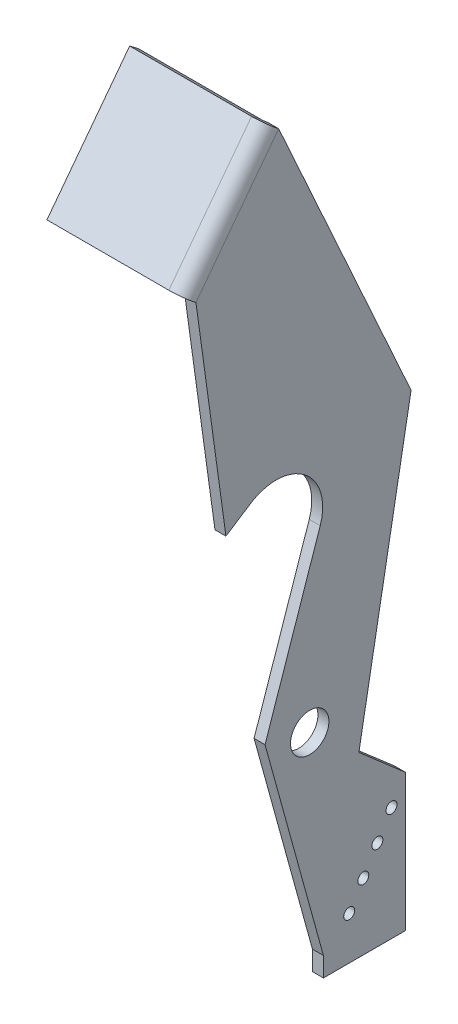
ISO-10303-21;
HEADER;
FILE_DESCRIPTION(('STEP AP214'),'2;1');
FILE_NAME('part.step','',(''),(''),'','','');
FILE_SCHEMA(('AUTOMOTIVE_DESIGN { 1 0 10303 214 1 1 1 1 }'));
ENDSEC;
DATA;
#1=APPLICATION_CONTEXT('core data for automotive mechanical design processes');
#2=APPLICATION_PROTOCOL_DEFINITION('international standard','automotive_design',2000,#1);
#3=PRODUCT_CONTEXT('',#1,'mechanical');
#4=PRODUCT('Part','Part','',(#3));
#5=PRODUCT_RELATED_PRODUCT_CATEGORY('part','',(#4));
#6=PRODUCT_DEFINITION_FORMATION('','',#4);
#7=PRODUCT_DEFINITION_CONTEXT('part definition',#1,'design');
#8=PRODUCT_DEFINITION('design','',#6,#7);
#9=PRODUCT_DEFINITION_SHAPE('','',#8);
#10=(LENGTH_UNIT() NAMED_UNIT(*) SI_UNIT(.MILLI.,.METRE.));
#11=(NAMED_UNIT(*) PLANE_ANGLE_UNIT() SI_UNIT($,.RADIAN.));
#12=(NAMED_UNIT(*) SI_UNIT($,.STERADIAN.) SOLID_ANGLE_UNIT());
#13=UNCERTAINTY_MEASURE_WITH_UNIT(LENGTH_MEASURE(1.E-05),#10,'distance_accuracy_value','');
#14=(GEOMETRIC_REPRESENTATION_CONTEXT(3) GLOBAL_UNCERTAINTY_ASSIGNED_CONTEXT((#13)) GLOBAL_UNIT_ASSIGNED_CONTEXT((#10,
#11,#12)) REPRESENTATION_CONTEXT('',''));
#15=CARTESIAN_POINT('',(0.,0.,0.));
#16=DIRECTION('',(0.,0.,1.));
#17=DIRECTION('',(1.,0.,0.));
#18=AXIS2_PLACEMENT_3D('',#15,#16,#17);
#19=CARTESIAN_POINT('',(-4.,63.4401893519098,-3.84266830118097));
#20=DIRECTION('',(0.,0.322329469670201,0.946627547128292));
#21=DIRECTION('',(0.,-0.946627547128292,0.322329469670201));
#22=AXIS2_PLACEMENT_3D('',#19,#20,#21);
#23=PLANE('',#22);
#24=DIRECTION('',(0.,-0.946627547128292,0.322329469670201));
#25=VECTOR('',#24,1.);
#26=CARTESIAN_POINT('',(0.,63.4401893519098,-3.84266830118097));
#27=LINE('',#26,#25);
#28=CARTESIAN_POINT('',(0.,63.4401893519098,-3.84266830118096));
#29=VERTEX_POINT('',#28);
#30=CARTESIAN_POINT('',(0.,4.28462847097499,16.2999745203161));
#31=VERTEX_POINT('',#30);
#32=EDGE_CURVE('E177',#29,#31,#27,.T.);
#33=ORIENTED_EDGE('',*,*,#32,.F.);
#34=DIRECTION('',(1.,0.,0.));
#35=VECTOR('',#34,1.);
#36=CARTESIAN_POINT('',(-4.,63.4401893519098,-3.84266830118096));
#37=LINE('',#36,#35);
#38=CARTESIAN_POINT('',(-4.,63.4401893519098,-3.84266830118096));
#39=VERTEX_POINT('',#38);
#40=EDGE_CURVE('E13',#39,#29,#37,.T.);
#41=ORIENTED_EDGE('',*,*,#40,.F.);
#42=DIRECTION('',(0.,-0.946627547128292,0.322329469670201));
#43=VECTOR('',#42,1.);
#44=CARTESIAN_POINT('',(-4.,63.4401893519098,-3.84266830118097));
#45=LINE('',#44,#43);
#46=CARTESIAN_POINT('',(-4.,4.28462847097499,16.2999745203161));
#47=VERTEX_POINT('',#46);
#48=EDGE_CURVE('E210',#39,#47,#45,.T.);
#49=ORIENTED_EDGE('',*,*,#48,.T.);
#50=DIRECTION('',(1.,0.,0.));
#51=VECTOR('',#50,1.);
#52=CARTESIAN_POINT('',(-4.,4.28462847097499,16.2999745203161));
#53=LINE('',#52,#51);
#54=EDGE_CURVE('E61',#47,#31,#53,.T.);
#55=ORIENTED_EDGE('',*,*,#54,.T.);
#56=EDGE_LOOP('',(#33,#41,#49,#55));
#57=FACE_BOUND('',#56,.T.);
#58=ADVANCED_FACE('F58',(#57),#23,.T.);
#59=CARTESIAN_POINT('',(-4.,68.9197903363033,12.25));
#60=DIRECTION('',(1.,0.,0.));
#61=DIRECTION('',(0.,0.,-1.));
#62=AXIS2_PLACEMENT_3D('',#59,#60,#61);
#63=CYLINDRICAL_SURFACE('',#62,17.);
#64=CARTESIAN_POINT('',(0.,68.9197903363033,12.25));
#65=DIRECTION('',(-1.,0.,0.));
#66=DIRECTION('',(0.,0.,1.));
#67=AXIS2_PLACEMENT_3D('',#64,#65,#66);
#68=CIRCLE('',#67,17.);
#69=CARTESIAN_POINT('',(0.,83.2003084561341,21.4731666053034));
#70=VERTEX_POINT('',#69);
#71=EDGE_CURVE('E208',#70,#29,#68,.T.);
#72=ORIENTED_EDGE('',*,*,#71,.F.);
#73=DIRECTION('',(1.,0.,0.));
#74=VECTOR('',#73,1.);
#75=CARTESIAN_POINT('',(-4.,83.2003084561341,21.4731666053034));
#76=LINE('',#75,#74);
#77=CARTESIAN_POINT('',(-4.,83.2003084561341,21.4731666053034));
#78=VERTEX_POINT('',#77);
#79=EDGE_CURVE('E67',#78,#70,#76,.T.);
#80=ORIENTED_EDGE('',*,*,#79,.F.);
#81=CARTESIAN_POINT('',(-4.,68.9197903363033,12.25));
#82=DIRECTION('',(-1.,0.,0.));
#83=DIRECTION('',(0.,0.,1.));
#84=AXIS2_PLACEMENT_3D('',#81,#82,#83);
#85=CIRCLE('',#84,17.);
#86=EDGE_CURVE('E164',#78,#39,#85,.T.);
#87=ORIENTED_EDGE('',*,*,#86,.T.);
#88=ORIENTED_EDGE('',*,*,#40,.T.);
#89=EDGE_LOOP('',(#72,#80,#87,#88));
#90=FACE_BOUND('',#89,.T.);
#91=ADVANCED_FACE('F231',(#90),#63,.F.);
#92=CARTESIAN_POINT('',(-4.,83.2003084561341,21.4731666053034));
#93=DIRECTION('',(0.,-0.840030477637105,-0.542539212076674));
#94=DIRECTION('',(0.,0.542539212076674,-0.840030477637105));
#95=AXIS2_PLACEMENT_3D('',#92,#93,#94);
#96=PLANE('',#95);
#97=DIRECTION('',(0.,0.542539212076674,-0.840030477637105));
#98=VECTOR('',#97,1.);
#99=CARTESIAN_POINT('',(0.,83.2003084561341,21.4731666053034));
#100=LINE('',#99,#98);
#101=CARTESIAN_POINT('',(0.,77.3245033014224,30.5708600083702));
#102=VERTEX_POINT('',#101);
#103=EDGE_CURVE('E151',#102,#70,#100,.T.);
#104=ORIENTED_EDGE('',*,*,#103,.F.);
#105=DIRECTION('',(1.,0.,0.));
#106=VECTOR('',#105,1.);
#107=CARTESIAN_POINT('',(-4.,77.3245033014224,30.5708600083702));
#108=LINE('',#107,#106);
#109=CARTESIAN_POINT('',(-4.,77.3245033014224,30.5708600083702));
#110=VERTEX_POINT('',#109);
#111=EDGE_CURVE('E146',#110,#102,#108,.T.);
#112=ORIENTED_EDGE('',*,*,#111,.F.);
#113=DIRECTION('',(0.,0.542539212076674,-0.840030477637105));
#114=VECTOR('',#113,1.);
#115=CARTESIAN_POINT('',(-4.,83.2003084561341,21.4731666053034));
#116=LINE('',#115,#114);
#117=EDGE_CURVE('E149',#110,#78,#116,.T.);
#118=ORIENTED_EDGE('',*,*,#117,.T.);
#119=ORIENTED_EDGE('',*,*,#79,.T.);
#120=EDGE_LOOP('',(#104,#112,#118,#119));
#121=FACE_BOUND('',#120,.T.);
#122=ADVANCED_FACE('F148',(#121),#96,.T.);
#123=CARTESIAN_POINT('',(-4.,156.639911011266,41.5156399534278));
#124=DIRECTION('',(0.,-0.136695292409617,0.990613141964637));
#125=DIRECTION('',(0.,-0.990613141964637,-0.136695292409617));
#126=AXIS2_PLACEMENT_3D('',#123,#124,#125);
#127=PLANE('',#126);
#128=DIRECTION('',(0.,-0.990613141964637,-0.136695292409617));
#129=VECTOR('',#128,1.);
#130=CARTESIAN_POINT('',(0.,156.639911011266,41.5156399534278));
#131=LINE('',#130,#129);
#132=CARTESIAN_POINT('',(0.,156.639911011266,41.5156399534278));
#133=VERTEX_POINT('',#132);
#134=EDGE_CURVE('E205',#133,#102,#131,.T.);
#135=ORIENTED_EDGE('',*,*,#134,.F.);
#136=DIRECTION('',(1.,0.,0.));
#137=VECTOR('',#136,1.);
#138=CARTESIAN_POINT('',(-4.,156.639911011266,41.5156399534278));
#139=LINE('',#138,#137);
#140=CARTESIAN_POINT('',(-4.00000000000002,156.639911011266,41.5156399534278));
#141=VERTEX_POINT('',#140);
#142=EDGE_CURVE('E156',#141,#133,#139,.T.);
#143=ORIENTED_EDGE('',*,*,#142,.F.);
#144=DIRECTION('',(0.,-0.990613141964637,-0.136695292409617));
#145=VECTOR('',#144,1.);
#146=CARTESIAN_POINT('',(-4.,156.639911011266,41.5156399534278));
#147=LINE('',#146,#145);
#148=EDGE_CURVE('E163',#141,#110,#147,.T.);
#149=ORIENTED_EDGE('',*,*,#148,.T.);
#150=ORIENTED_EDGE('',*,*,#111,.T.);
#151=EDGE_LOOP('',(#135,#143,#149,#150));
#152=FACE_BOUND('',#151,.T.);
#153=ADVANCED_FACE('F167',(#152),#127,.T.);
#154=CARTESIAN_POINT('',(-4.,89.6650963066228,-37.));
#155=DIRECTION('',(0.,0.412144442222116,-0.911118520690596));
#156=DIRECTION('',(0.,0.911118520690596,0.412144442222116));
#157=AXIS2_PLACEMENT_3D('',#154,#155,#156);
#158=PLANE('',#157);
#159=DIRECTION('',(0.,0.911118520690596,0.412144442222116));
#160=VECTOR('',#159,1.);
#161=CARTESIAN_POINT('',(0.,89.6650963066228,-37.));
#162=LINE('',#161,#160);
#163=CARTESIAN_POINT('',(0.,89.6650963066228,-37.));
#164=VERTEX_POINT('',#163);
#165=CARTESIAN_POINT('',(0.,196.496282933007,11.3250848535983));
#166=VERTEX_POINT('',#165);
#167=EDGE_CURVE('E199',#164,#166,#162,.T.);
#168=ORIENTED_EDGE('',*,*,#167,.F.);
#169=DIRECTION('',(1.,0.,0.));
#170=VECTOR('',#169,1.);
#171=CARTESIAN_POINT('',(-4.,89.6650963066228,-37.));
#172=LINE('',#171,#170);
#173=CARTESIAN_POINT('',(-4.,89.6650963066228,-37.));
#174=VERTEX_POINT('',#173);
#175=EDGE_CURVE('E217',#174,#164,#172,.T.);
#176=ORIENTED_EDGE('',*,*,#175,.F.);
#177=DIRECTION('',(0.,0.911118520690596,0.412144442222116));
#178=VECTOR('',#177,1.);
#179=CARTESIAN_POINT('',(-4.,89.6650963066228,-37.));
#180=LINE('',#179,#178);
#181=CARTESIAN_POINT('',(-4.00000000000002,196.496282933007,11.3250848535983));
#182=VERTEX_POINT('',#181);
#183=EDGE_CURVE('E172',#174,#182,#180,.T.);
#184=ORIENTED_EDGE('',*,*,#183,.T.);
#185=DIRECTION('',(1.,0.,0.));
#186=VECTOR('',#185,1.);
#187=CARTESIAN_POINT('',(-4.,196.496282933007,11.3250848535983));
#188=LINE('',#187,#186);
#189=EDGE_CURVE('E214',#182,#166,#188,.T.);
#190=ORIENTED_EDGE('',*,*,#189,.T.);
#191=EDGE_LOOP('',(#168,#176,#184,#190));
#192=FACE_BOUND('',#191,.T.);
#193=ADVANCED_FACE('F244',(#192),#158,.T.);
#194=CARTESIAN_POINT('',(-4.,-15.2866861849528,-17.9522006629487));
#195=DIRECTION('',(0.,-0.178573765967968,-0.983926526783386));
#196=DIRECTION('',(0.,0.983926526783386,-0.178573765967968));
#197=AXIS2_PLACEMENT_3D('',#194,#195,#196);
#198=PLANE('',#197);
#199=DIRECTION('',(0.,0.983926526783386,-0.178573765967968));
#200=VECTOR('',#199,1.);
#201=CARTESIAN_POINT('',(0.,-15.2866861849528,-17.9522006629487));
#202=LINE('',#201,#200);
#203=CARTESIAN_POINT('',(0.,-15.2866861849528,-17.9522006629487));
#204=VERTEX_POINT('',#203);
#205=EDGE_CURVE('E196',#204,#164,#202,.T.);
#206=ORIENTED_EDGE('',*,*,#205,.F.);
#207=DIRECTION('',(1.,0.,0.));
#208=VECTOR('',#207,1.);
#209=CARTESIAN_POINT('',(-4.,-15.2866861849528,-17.9522006629487));
#210=LINE('',#209,#208);
#211=CARTESIAN_POINT('',(-4.,-15.2866861849528,-17.9522006629487));
#212=VERTEX_POINT('',#211);
#213=EDGE_CURVE('E219',#212,#204,#210,.T.);
#214=ORIENTED_EDGE('',*,*,#213,.F.);
#215=DIRECTION('',(0.,0.983926526783386,-0.178573765967968));
#216=VECTOR('',#215,1.);
#217=CARTESIAN_POINT('',(-4.,-15.2866861849528,-17.9522006629487));
#218=LINE('',#217,#216);
#219=EDGE_CURVE('E436',#212,#174,#218,.T.);
#220=ORIENTED_EDGE('',*,*,#219,.T.);
#221=ORIENTED_EDGE('',*,*,#175,.T.);
#222=EDGE_LOOP('',(#206,#214,#220,#221));
#223=FACE_BOUND('',#222,.T.);
#224=ADVANCED_FACE('F247',(#223),#198,.T.);
#225=CARTESIAN_POINT('',(-4.,-30.1092645252368,-35.));
#226=DIRECTION('',(0.,0.75464048126496,-0.656138509795143));
#227=DIRECTION('',(0.,0.656138509795143,0.75464048126496));
#228=AXIS2_PLACEMENT_3D('',#225,#226,#227);
#229=PLANE('',#228);
#230=DIRECTION('',(0.,0.656138509795143,0.75464048126496));
#231=VECTOR('',#230,1.);
#232=CARTESIAN_POINT('',(0.,-30.1092645252368,-35.));
#233=LINE('',#232,#231);
#234=CARTESIAN_POINT('',(0.,-30.1092645252368,-35.));
#235=VERTEX_POINT('',#234);
#236=EDGE_CURVE('E193',#235,#204,#233,.T.);
#237=ORIENTED_EDGE('',*,*,#236,.F.);
#238=DIRECTION('',(1.,0.,0.));
#239=VECTOR('',#238,1.);
#240=CARTESIAN_POINT('',(-4.,-30.1092645252368,-35.));
#241=LINE('',#240,#239);
#242=CARTESIAN_POINT('',(-4.,-30.1092645252368,-35.));
#243=VERTEX_POINT('',#242);
#244=EDGE_CURVE('E221',#243,#235,#241,.T.);
#245=ORIENTED_EDGE('',*,*,#244,.F.);
#246=DIRECTION('',(0.,0.656138509795143,0.75464048126496));
#247=VECTOR('',#246,1.);
#248=CARTESIAN_POINT('',(-4.,-30.1092645252368,-35.));
#249=LINE('',#248,#247);
#250=EDGE_CURVE('E433',#243,#212,#249,.T.);
#251=ORIENTED_EDGE('',*,*,#250,.T.);
#252=ORIENTED_EDGE('',*,*,#213,.T.);
#253=EDGE_LOOP('',(#237,#245,#251,#252));
#254=FACE_BOUND('',#253,.T.);
#255=ADVANCED_FACE('F251',(#254),#229,.T.);
#256=CARTESIAN_POINT('',(-4.,-30.1092645252368,-35.));
#257=DIRECTION('',(0.,0.,-1.));
#258=DIRECTION('',(-1.,0.,0.));
#259=AXIS2_PLACEMENT_3D('',#256,#257,#258);
#260=PLANE('',#259);
#261=DIRECTION('',(0.,1.,0.));
#262=VECTOR('',#261,1.);
#263=CARTESIAN_POINT('',(0.,-30.1092645252368,-35.));
#264=LINE('',#263,#262);
#265=CARTESIAN_POINT('',(0.,-80.1092645252368,-35.));
#266=VERTEX_POINT('',#265);
#267=EDGE_CURVE('E190',#266,#235,#264,.T.);
#268=ORIENTED_EDGE('',*,*,#267,.F.);
#269=DIRECTION('',(1.,0.,0.));
#270=VECTOR('',#269,1.);
#271=CARTESIAN_POINT('',(-4.,-80.1092645252368,-35.));
#272=LINE('',#271,#270);
#273=CARTESIAN_POINT('',(-4.,-80.1092645252368,-35.));
#274=VERTEX_POINT('',#273);
#275=EDGE_CURVE('E223',#274,#266,#272,.T.);
#276=ORIENTED_EDGE('',*,*,#275,.F.);
#277=DIRECTION('',(0.,1.,0.));
#278=VECTOR('',#277,1.);
#279=CARTESIAN_POINT('',(-4.,-30.1092645252368,-35.));
#280=LINE('',#279,#278);
#281=EDGE_CURVE('E430',#274,#243,#280,.T.);
#282=ORIENTED_EDGE('',*,*,#281,.T.);
#283=ORIENTED_EDGE('',*,*,#244,.T.);
#284=EDGE_LOOP('',(#268,#276,#282,#283));
#285=FACE_BOUND('',#284,.T.);
#286=ADVANCED_FACE('F255',(#285),#260,.T.);
#287=CARTESIAN_POINT('',(-4.,-80.1092645252368,-5.));
#288=DIRECTION('',(0.,-1.,0.));
#289=DIRECTION('',(0.,0.,-1.));
#290=AXIS2_PLACEMENT_3D('',#287,#288,#289);
#291=PLANE('',#290);
#292=DIRECTION('',(0.,0.,-1.));
#293=VECTOR('',#292,1.);
#294=CARTESIAN_POINT('',(0.,-80.1092645252368,-5.));
#295=LINE('',#294,#293);
#296=CARTESIAN_POINT('',(0.,-80.1092645252368,-5.));
#297=VERTEX_POINT('',#296);
#298=EDGE_CURVE('E187',#297,#266,#295,.T.);
#299=ORIENTED_EDGE('',*,*,#298,.F.);
#300=DIRECTION('',(1.,0.,0.));
#301=VECTOR('',#300,1.);
#302=CARTESIAN_POINT('',(-4.,-80.1092645252368,-5.));
#303=LINE('',#302,#301);
#304=CARTESIAN_POINT('',(-4.,-80.1092645252368,-5.));
#305=VERTEX_POINT('',#304);
#306=EDGE_CURVE('E225',#305,#297,#303,.T.);
#307=ORIENTED_EDGE('',*,*,#306,.F.);
#308=DIRECTION('',(0.,0.,-1.));
#309=VECTOR('',#308,1.);
#310=CARTESIAN_POINT('',(-4.,-80.1092645252368,-5.));
#311=LINE('',#310,#309);
#312=EDGE_CURVE('E427',#305,#274,#311,.T.);
#313=ORIENTED_EDGE('',*,*,#312,.T.);
#314=ORIENTED_EDGE('',*,*,#275,.T.);
#315=EDGE_LOOP('',(#299,#307,#313,#314));
#316=FACE_BOUND('',#315,.T.);
#317=ADVANCED_FACE('F259',(#316),#291,.T.);
#318=CARTESIAN_POINT('',(-4.,-72.9877114530115,-5.00000000000001));
#319=DIRECTION('',(0.,0.,1.));
#320=DIRECTION('',(0.,-1.,0.));
#321=AXIS2_PLACEMENT_3D('',#318,#319,#320);
#322=PLANE('',#321);
#323=DIRECTION('',(0.,-1.,0.));
#324=VECTOR('',#323,1.);
#325=CARTESIAN_POINT('',(0.,-72.9877114530115,-5.00000000000001));
#326=LINE('',#325,#324);
#327=CARTESIAN_POINT('',(0.,-72.9877114530115,-5.00000000000001));
#328=VERTEX_POINT('',#327);
#329=EDGE_CURVE('E184',#328,#297,#326,.T.);
#330=ORIENTED_EDGE('',*,*,#329,.F.);
#331=DIRECTION('',(1.,0.,0.));
#332=VECTOR('',#331,1.);
#333=CARTESIAN_POINT('',(-4.,-72.9877114530115,-5.00000000000001));
#334=LINE('',#333,#332);
#335=CARTESIAN_POINT('',(-4.,-72.9877114530115,-5.00000000000001));
#336=VERTEX_POINT('',#335);
#337=EDGE_CURVE('E226',#336,#328,#334,.T.);
#338=ORIENTED_EDGE('',*,*,#337,.F.);
#339=DIRECTION('',(0.,-1.,0.));
#340=VECTOR('',#339,1.);
#341=CARTESIAN_POINT('',(-4.,-72.9877114530115,-5.00000000000001));
#342=LINE('',#341,#340);
#343=EDGE_CURVE('E424',#336,#305,#342,.T.);
#344=ORIENTED_EDGE('',*,*,#343,.T.);
#345=ORIENTED_EDGE('',*,*,#306,.T.);
#346=EDGE_LOOP('',(#330,#338,#344,#345));
#347=FACE_BOUND('',#346,.T.);
#348=ADVANCED_FACE('F263',(#347),#322,.T.);
#349=CARTESIAN_POINT('',(-4.,4.28462847097499,16.2999745203161));
#350=DIRECTION('',(0.,-0.26573731422864,0.964045476015809));
#351=DIRECTION('',(0.,-0.96404547601581,-0.26573731422864));
#352=AXIS2_PLACEMENT_3D('',#349,#350,#351);
#353=PLANE('',#352);
#354=DIRECTION('',(0.,-0.964045476015809,-0.26573731422864));
#355=VECTOR('',#354,1.);
#356=CARTESIAN_POINT('',(0.,4.28462847097499,16.2999745203161));
#357=LINE('',#356,#355);
#358=EDGE_CURVE('E180',#31,#328,#357,.T.);
#359=ORIENTED_EDGE('',*,*,#358,.F.);
#360=ORIENTED_EDGE('',*,*,#54,.F.);
#361=DIRECTION('',(0.,-0.964045476015809,-0.26573731422864));
#362=VECTOR('',#361,1.);
#363=CARTESIAN_POINT('',(-4.,4.28462847097499,16.2999745203161));
#364=LINE('',#363,#362);
#365=EDGE_CURVE('E422',#47,#336,#364,.T.);
#366=ORIENTED_EDGE('',*,*,#365,.T.);
#367=ORIENTED_EDGE('',*,*,#337,.T.);
#368=EDGE_LOOP('',(#359,#360,#366,#367));
#369=FACE_BOUND('',#368,.T.);
#370=ADVANCED_FACE('F228',(#369),#353,.T.);
#371=CARTESIAN_POINT('',(-4.,68.9197903363033,12.25));
#372=DIRECTION('',(-1.,0.,0.));
#373=DIRECTION('',(0.,0.,1.));
#374=AXIS2_PLACEMENT_3D('',#371,#372,#373);
#375=PLANE('',#374);
#376=CARTESIAN_POINT('',(-4.,-64.4089815537385,-14.420169782899));
#377=DIRECTION('',(1.,0.,0.));
#378=DIRECTION('',(0.,0.,-1.));
#379=AXIS2_PLACEMENT_3D('',#376,#377,#378);
#380=CIRCLE('',#379,2.00000000000001);
#381=CARTESIAN_POINT('',(-4.,-64.4089815537385,-16.420169782899));
#382=VERTEX_POINT('',#381);
#383=EDGE_CURVE('E394',#382,#382,#380,.T.);
#384=ORIENTED_EDGE('',*,*,#383,.T.);
#385=EDGE_LOOP('',(#384));
#386=FACE_BOUND('',#385,.T.);
#387=CARTESIAN_POINT('',(-4.,-55.8340522966131,-19.5651273371742));
#388=DIRECTION('',(1.,0.,0.));
#389=DIRECTION('',(0.,0.,-1.));
#390=AXIS2_PLACEMENT_3D('',#387,#388,#389);
#391=CIRCLE('',#390,2.00000000000001);
#392=CARTESIAN_POINT('',(-4.,-55.8340522966131,-21.5651273371742));
#393=VERTEX_POINT('',#392);
#394=EDGE_CURVE('E399',#393,#393,#391,.T.);
#395=ORIENTED_EDGE('',*,*,#394,.T.);
#396=EDGE_LOOP('',(#395));
#397=FACE_BOUND('',#396,.T.);
#398=CARTESIAN_POINT('',(-4.,-47.2591230394876,-24.7100848914495));
#399=DIRECTION('',(1.,0.,0.));
#400=DIRECTION('',(0.,0.,-1.));
#401=AXIS2_PLACEMENT_3D('',#398,#399,#400);
#402=CIRCLE('',#401,2.);
#403=CARTESIAN_POINT('',(-4.,-47.2591230394876,-26.7100848914495));
#404=VERTEX_POINT('',#403);
#405=EDGE_CURVE('E405',#404,#404,#402,.T.);
#406=ORIENTED_EDGE('',*,*,#405,.T.);
#407=EDGE_LOOP('',(#406));
#408=FACE_BOUND('',#407,.T.);
#409=CARTESIAN_POINT('',(-4.,-38.6841937823622,-29.8550424457247));
#410=DIRECTION('',(1.,0.,0.));
#411=DIRECTION('',(0.,0.,-1.));
#412=AXIS2_PLACEMENT_3D('',#409,#410,#411);
#413=CIRCLE('',#412,2.00000000000001);
#414=CARTESIAN_POINT('',(-4.,-38.6841937823622,-31.8550424457247));
#415=VERTEX_POINT('',#414);
#416=EDGE_CURVE('E411',#415,#415,#413,.T.);
#417=ORIENTED_EDGE('',*,*,#416,.T.);
#418=EDGE_LOOP('',(#417));
#419=FACE_BOUND('',#418,.T.);
#420=CARTESIAN_POINT('',(-4.,0.,0.));
#421=DIRECTION('',(1.,0.,0.));
#422=DIRECTION('',(0.,0.,-1.));
#423=AXIS2_PLACEMENT_3D('',#420,#421,#422);
#424=CIRCLE('',#423,7.);
#425=CARTESIAN_POINT('',(-4.,0.,-7.));
#426=VERTEX_POINT('',#425);
#427=EDGE_CURVE('E181',#426,#426,#424,.T.);
#428=ORIENTED_EDGE('',*,*,#427,.T.);
#429=EDGE_LOOP('',(#428));
#430=FACE_BOUND('',#429,.T.);
#431=ORIENTED_EDGE('',*,*,#48,.F.);
#432=ORIENTED_EDGE('',*,*,#86,.F.);
#433=ORIENTED_EDGE('',*,*,#117,.F.);
#434=ORIENTED_EDGE('',*,*,#148,.F.);
#435=DIRECTION('',(0.,-0.797127438434824,0.603811101996589));
#436=VECTOR('',#435,1.);
#437=CARTESIAN_POINT('',(-4.,196.496282933007,11.3250848535983));
#438=LINE('',#437,#436);
#439=EDGE_CURVE('E169',#182,#141,#438,.T.);
#440=ORIENTED_EDGE('',*,*,#439,.F.);
#441=ORIENTED_EDGE('',*,*,#183,.F.);
#442=ORIENTED_EDGE('',*,*,#219,.F.);
#443=ORIENTED_EDGE('',*,*,#250,.F.);
#444=ORIENTED_EDGE('',*,*,#281,.F.);
#445=ORIENTED_EDGE('',*,*,#312,.F.);
#446=ORIENTED_EDGE('',*,*,#343,.F.);
#447=ORIENTED_EDGE('',*,*,#365,.F.);
#448=EDGE_LOOP('',(#431,#432,#433,#434,#440,#441,#442,#443,#444,#445,#446,#447));
#449=FACE_BOUND('',#448,.T.);
#450=ADVANCED_FACE('F160',(#386,#397,#408,#419,#430,#449),#375,.T.);
#451=CARTESIAN_POINT('',(0.,68.9197903363033,12.25));
#452=DIRECTION('',(-1.,0.,0.));
#453=DIRECTION('',(0.,0.,1.));
#454=AXIS2_PLACEMENT_3D('',#451,#452,#453);
#455=PLANE('',#454);
#456=CARTESIAN_POINT('',(0.,-64.4089815537385,-14.420169782899));
#457=DIRECTION('',(1.,0.,0.));
#458=DIRECTION('',(0.,0.,-1.));
#459=AXIS2_PLACEMENT_3D('',#456,#457,#458);
#460=CIRCLE('',#459,2.00000000000001);
#461=CARTESIAN_POINT('',(0.,-64.4089815537385,-16.420169782899));
#462=VERTEX_POINT('',#461);
#463=EDGE_CURVE('E384',#462,#462,#460,.T.);
#464=ORIENTED_EDGE('',*,*,#463,.F.);
#465=EDGE_LOOP('',(#464));
#466=FACE_BOUND('',#465,.T.);
#467=CARTESIAN_POINT('',(0.,-55.8340522966131,-19.5651273371742));
#468=DIRECTION('',(1.,0.,0.));
#469=DIRECTION('',(0.,0.,-1.));
#470=AXIS2_PLACEMENT_3D('',#467,#468,#469);
#471=CIRCLE('',#470,2.00000000000001);
#472=CARTESIAN_POINT('',(0.,-55.8340522966131,-21.5651273371742));
#473=VERTEX_POINT('',#472);
#474=EDGE_CURVE('E396',#473,#473,#471,.T.);
#475=ORIENTED_EDGE('',*,*,#474,.F.);
#476=EDGE_LOOP('',(#475));
#477=FACE_BOUND('',#476,.T.);
#478=CARTESIAN_POINT('',(0.,-47.2591230394876,-24.7100848914495));
#479=DIRECTION('',(1.,0.,0.));
#480=DIRECTION('',(0.,0.,-1.));
#481=AXIS2_PLACEMENT_3D('',#478,#479,#480);
#482=CIRCLE('',#481,2.);
#483=CARTESIAN_POINT('',(0.,-47.2591230394876,-26.7100848914495));
#484=VERTEX_POINT('',#483);
#485=EDGE_CURVE('E402',#484,#484,#482,.T.);
#486=ORIENTED_EDGE('',*,*,#485,.F.);
#487=EDGE_LOOP('',(#486));
#488=FACE_BOUND('',#487,.T.);
#489=CARTESIAN_POINT('',(0.,-38.6841937823622,-29.8550424457247));
#490=DIRECTION('',(1.,0.,0.));
#491=DIRECTION('',(0.,0.,-1.));
#492=AXIS2_PLACEMENT_3D('',#489,#490,#491);
#493=CIRCLE('',#492,2.00000000000001);
#494=CARTESIAN_POINT('',(0.,-38.6841937823622,-31.8550424457247));
#495=VERTEX_POINT('',#494);
#496=EDGE_CURVE('E408',#495,#495,#493,.T.);
#497=ORIENTED_EDGE('',*,*,#496,.F.);
#498=EDGE_LOOP('',(#497));
#499=FACE_BOUND('',#498,.T.);
#500=CARTESIAN_POINT('',(0.,0.,0.));
#501=DIRECTION('',(1.,0.,0.));
#502=DIRECTION('',(0.,0.,-1.));
#503=AXIS2_PLACEMENT_3D('',#500,#501,#502);
#504=CIRCLE('',#503,7.);
#505=CARTESIAN_POINT('',(0.,0.,-7.));
#506=VERTEX_POINT('',#505);
#507=EDGE_CURVE('E414',#506,#506,#504,.T.);
#508=ORIENTED_EDGE('',*,*,#507,.F.);
#509=EDGE_LOOP('',(#508));
#510=FACE_BOUND('',#509,.T.);
#511=ORIENTED_EDGE('',*,*,#32,.T.);
#512=ORIENTED_EDGE('',*,*,#358,.T.);
#513=ORIENTED_EDGE('',*,*,#329,.T.);
#514=ORIENTED_EDGE('',*,*,#298,.T.);
#515=ORIENTED_EDGE('',*,*,#267,.T.);
#516=ORIENTED_EDGE('',*,*,#236,.T.);
#517=ORIENTED_EDGE('',*,*,#205,.T.);
#518=ORIENTED_EDGE('',*,*,#167,.T.);
#519=DIRECTION('',(0.,-0.797127438434824,0.603811101996589));
#520=VECTOR('',#519,1.);
#521=CARTESIAN_POINT('',(0.,196.496282933007,11.3250848535983));
#522=LINE('',#521,#520);
#523=EDGE_CURVE('E202',#166,#133,#522,.T.);
#524=ORIENTED_EDGE('',*,*,#523,.T.);
#525=ORIENTED_EDGE('',*,*,#134,.T.);
#526=ORIENTED_EDGE('',*,*,#103,.T.);
#527=ORIENTED_EDGE('',*,*,#71,.T.);
#528=EDGE_LOOP('',(#511,#512,#513,#514,#515,#516,#517,#518,#524,#525,#526,#527));
#529=FACE_BOUND('',#528,.T.);
#530=ADVANCED_FACE('F230',(#466,#477,#488,#499,#510,#529),#455,.F.);
#531=CARTESIAN_POINT('',(-4.,0.,0.));
#532=DIRECTION('',(1.,0.,0.));
#533=DIRECTION('',(0.,0.,-1.));
#534=AXIS2_PLACEMENT_3D('',#531,#532,#533);
#535=CYLINDRICAL_SURFACE('',#534,7.);
#536=ORIENTED_EDGE('',*,*,#427,.F.);
#537=EDGE_LOOP('',(#536));
#538=FACE_BOUND('',#537,.T.);
#539=ORIENTED_EDGE('',*,*,#507,.T.);
#540=EDGE_LOOP('',(#539));
#541=FACE_BOUND('',#540,.T.);
#542=ADVANCED_FACE('F275',(#538,#541),#535,.F.);
#543=CARTESIAN_POINT('',(-4.,-38.6841937823622,-29.8550424457247));
#544=DIRECTION('',(1.,0.,0.));
#545=DIRECTION('',(0.,0.,-1.));
#546=AXIS2_PLACEMENT_3D('',#543,#544,#545);
#547=CYLINDRICAL_SURFACE('',#546,2.00000000000001);
#548=ORIENTED_EDGE('',*,*,#416,.F.);
#549=EDGE_LOOP('',(#548));
#550=FACE_BOUND('',#549,.T.);
#551=ORIENTED_EDGE('',*,*,#496,.T.);
#552=EDGE_LOOP('',(#551));
#553=FACE_BOUND('',#552,.T.);
#554=ADVANCED_FACE('F282',(#550,#553),#547,.F.);
#555=CARTESIAN_POINT('',(-4.,-47.2591230394876,-24.7100848914495));
#556=DIRECTION('',(1.,0.,0.));
#557=DIRECTION('',(0.,0.,-1.));
#558=AXIS2_PLACEMENT_3D('',#555,#556,#557);
#559=CYLINDRICAL_SURFACE('',#558,2.);
#560=ORIENTED_EDGE('',*,*,#405,.F.);
#561=EDGE_LOOP('',(#560));
#562=FACE_BOUND('',#561,.T.);
#563=ORIENTED_EDGE('',*,*,#485,.T.);
#564=EDGE_LOOP('',(#563));
#565=FACE_BOUND('',#564,.T.);
#566=ADVANCED_FACE('F286',(#562,#565),#559,.F.);
#567=CARTESIAN_POINT('',(-4.,-55.8340522966131,-19.5651273371742));
#568=DIRECTION('',(1.,0.,0.));
#569=DIRECTION('',(0.,0.,-1.));
#570=AXIS2_PLACEMENT_3D('',#567,#568,#569);
#571=CYLINDRICAL_SURFACE('',#570,2.00000000000001);
#572=ORIENTED_EDGE('',*,*,#394,.F.);
#573=EDGE_LOOP('',(#572));
#574=FACE_BOUND('',#573,.T.);
#575=ORIENTED_EDGE('',*,*,#474,.T.);
#576=EDGE_LOOP('',(#575));
#577=FACE_BOUND('',#576,.T.);
#578=ADVANCED_FACE('F290',(#574,#577),#571,.F.);
#579=CARTESIAN_POINT('',(-4.,-64.4089815537385,-14.420169782899));
#580=DIRECTION('',(1.,0.,0.));
#581=DIRECTION('',(0.,0.,-1.));
#582=AXIS2_PLACEMENT_3D('',#579,#580,#581);
#583=CYLINDRICAL_SURFACE('',#582,2.00000000000001);
#584=ORIENTED_EDGE('',*,*,#383,.F.);
#585=EDGE_LOOP('',(#584));
#586=FACE_BOUND('',#585,.T.);
#587=ORIENTED_EDGE('',*,*,#463,.T.);
#588=EDGE_LOOP('',(#587));
#589=FACE_BOUND('',#588,.T.);
#590=ADVANCED_FACE('F294',(#586,#589),#583,.F.);
#591=CARTESIAN_POINT('',(-5.50000000000001,156.639911011266,41.5156399534278));
#592=DIRECTION('',(0.,-0.797127438434824,0.60381110199659));
#593=DIRECTION('',(0.,-0.60381110199659,-0.797127438434824));
#594=AXIS2_PLACEMENT_3D('',#591,#592,#593);
#595=PLANE('',#594);
#596=DIRECTION('',(0.,-0.603811101996589,-0.797127438434824));
#597=VECTOR('',#596,1.);
#598=CARTESIAN_POINT('',(-5.49999999999999,159.960872072247,45.8998408648194));
#599=LINE('',#598,#597);
#600=CARTESIAN_POINT('',(-5.50000000000001,157.545627664261,42.7113311110801));
#601=VERTEX_POINT('',#600);
#602=CARTESIAN_POINT('',(-5.49999999999999,159.960872072247,45.8998408648194));
#603=VERTEX_POINT('',#602);
#604=EDGE_CURVE('E379',#601,#603,#599,.F.);
#605=ORIENTED_EDGE('',*,*,#604,.F.);
#606=CARTESIAN_POINT('',(-5.50000000000001,156.639911011266,41.5156399534278));
#607=DIRECTION('',(0.,0.797127438434824,-0.60381110199659));
#608=DIRECTION('',(0.,0.60381110199659,0.797127438434824));
#609=AXIS2_PLACEMENT_3D('',#606,#607,#608);
#610=CIRCLE('',#609,1.49999999999999);
#611=EDGE_CURVE('E388',#141,#601,#610,.F.);
#612=ORIENTED_EDGE('',*,*,#611,.F.);
#613=ORIENTED_EDGE('',*,*,#142,.T.);
#614=CARTESIAN_POINT('',(-5.50000000000001,156.639911011266,41.5156399534278));
#615=DIRECTION('',(0.,0.797127438434824,-0.60381110199659));
#616=DIRECTION('',(0.,0.60381110199659,0.797127438434824));
#617=AXIS2_PLACEMENT_3D('',#614,#615,#616);
#618=CIRCLE('',#617,5.49999999999999);
#619=EDGE_CURVE('E381',#133,#603,#618,.F.);
#620=ORIENTED_EDGE('',*,*,#619,.T.);
#621=EDGE_LOOP('',(#605,#612,#613,#620));
#622=FACE_BOUND('',#621,.T.);
#623=ADVANCED_FACE('F298',(#622),#595,.T.);
#624=CARTESIAN_POINT('',(-5.50000000000001,196.496282933007,11.3250848535983));
#625=DIRECTION('',(0.,-0.797127438434824,0.60381110199659));
#626=DIRECTION('',(0.,-0.60381110199659,-0.797127438434824));
#627=AXIS2_PLACEMENT_3D('',#624,#625,#626);
#628=PLANE('',#627);
#629=CARTESIAN_POINT('',(-5.50000000000001,196.496282933007,11.3250848535983));
#630=DIRECTION('',(0.,0.797127438434824,-0.60381110199659));
#631=DIRECTION('',(0.,0.60381110199659,0.797127438434824));
#632=AXIS2_PLACEMENT_3D('',#629,#630,#631);
#633=CIRCLE('',#632,1.49999999999999);
#634=CARTESIAN_POINT('',(-5.50000000000001,197.401999586002,12.5207760112506));
#635=VERTEX_POINT('',#634);
#636=EDGE_CURVE('E391',#635,#182,#633,.T.);
#637=ORIENTED_EDGE('',*,*,#636,.F.);
#638=DIRECTION('',(0.,-0.603811101996589,-0.797127438434824));
#639=VECTOR('',#638,1.);
#640=CARTESIAN_POINT('',(-5.50000000000001,197.401999586002,12.5207760112506));
#641=LINE('',#640,#639);
#642=CARTESIAN_POINT('',(-5.49999999999999,199.817243993989,15.7092857649899));
#643=VERTEX_POINT('',#642);
#644=EDGE_CURVE('E373',#635,#643,#641,.F.);
#645=ORIENTED_EDGE('',*,*,#644,.T.);
#646=CARTESIAN_POINT('',(-5.50000000000001,196.496282933007,11.3250848535983));
#647=DIRECTION('',(0.,0.797127438434824,-0.60381110199659));
#648=DIRECTION('',(0.,0.60381110199659,0.797127438434824));
#649=AXIS2_PLACEMENT_3D('',#646,#647,#648);
#650=CIRCLE('',#649,5.49999999999999);
#651=EDGE_CURVE('E385',#643,#166,#650,.T.);
#652=ORIENTED_EDGE('',*,*,#651,.T.);
#653=ORIENTED_EDGE('',*,*,#189,.F.);
#654=EDGE_LOOP('',(#637,#645,#652,#653));
#655=FACE_BOUND('',#654,.T.);
#656=ADVANCED_FACE('F300',(#655),#628,.F.);
#657=CARTESIAN_POINT('',(-5.50000000000001,196.496282933007,11.3250848535983));
#658=DIRECTION('',(0.,0.797127438434824,-0.60381110199659));
#659=DIRECTION('',(0.,0.60381110199659,0.797127438434824));
#660=AXIS2_PLACEMENT_3D('',#657,#658,#659);
#661=CYLINDRICAL_SURFACE('',#660,5.49999999999999);
#662=ORIENTED_EDGE('',*,*,#523,.F.);
#663=ORIENTED_EDGE('',*,*,#651,.F.);
#664=DIRECTION('',(0.,0.797127438434824,-0.603811101996589));
#665=VECTOR('',#664,1.);
#666=CARTESIAN_POINT('',(-5.49999999999999,80.4120441659244,106.156787401457));
#667=LINE('',#666,#665);
#668=EDGE_CURVE('E345',#603,#643,#667,.T.);
#669=ORIENTED_EDGE('',*,*,#668,.F.);
#670=ORIENTED_EDGE('',*,*,#619,.F.);
#671=EDGE_LOOP('',(#662,#663,#669,#670));
#672=FACE_BOUND('',#671,.T.);
#673=ADVANCED_FACE('F303',(#672),#661,.T.);
#674=CARTESIAN_POINT('',(-5.50000000000001,196.496282933007,11.3250848535983));
#675=DIRECTION('',(0.,0.797127438434824,-0.60381110199659));
#676=DIRECTION('',(0.,0.60381110199659,0.797127438434824));
#677=AXIS2_PLACEMENT_3D('',#674,#675,#676);
#678=CYLINDRICAL_SURFACE('',#677,1.49999999999999);
#679=ORIENTED_EDGE('',*,*,#439,.T.);
#680=ORIENTED_EDGE('',*,*,#611,.T.);
#681=DIRECTION('',(0.,-0.797127438434824,0.603811101996589));
#682=VECTOR('',#681,1.);
#683=CARTESIAN_POINT('',(-5.50000000000001,157.545627664261,42.7113311110801));
#684=LINE('',#683,#682);
#685=EDGE_CURVE('E376',#601,#635,#684,.F.);
#686=ORIENTED_EDGE('',*,*,#685,.T.);
#687=ORIENTED_EDGE('',*,*,#636,.T.);
#688=EDGE_LOOP('',(#679,#680,#686,#687));
#689=FACE_BOUND('',#688,.T.);
#690=ADVANCED_FACE('F308',(#689),#678,.F.);
#691=CARTESIAN_POINT('',(-3.99999999999999,199.817243993989,15.7092857649899));
#692=DIRECTION('',(0.,-0.797127438434824,0.603811101996589));
#693=DIRECTION('',(0.,-0.603811101996589,-0.797127438434824));
#694=AXIS2_PLACEMENT_3D('',#691,#692,#693);
#695=PLANE('',#694);
#696=ORIENTED_EDGE('',*,*,#644,.F.);
#697=DIRECTION('',(-1.,0.,0.));
#698=VECTOR('',#697,1.);
#699=CARTESIAN_POINT('',(-4.,197.401999586002,12.5207760112506));
#700=LINE('',#699,#698);
#701=CARTESIAN_POINT('',(-50.,197.401999586002,12.5207760112507));
#702=VERTEX_POINT('',#701);
#703=EDGE_CURVE('E369',#635,#702,#700,.T.);
#704=ORIENTED_EDGE('',*,*,#703,.T.);
#705=DIRECTION('',(0.,-0.603811101996589,-0.797127438434824));
#706=VECTOR('',#705,1.);
#707=CARTESIAN_POINT('',(-50.,199.817243993989,15.70928576499));
#708=LINE('',#707,#706);
#709=CARTESIAN_POINT('',(-50.,199.817243993989,15.70928576499));
#710=VERTEX_POINT('',#709);
#711=EDGE_CURVE('E356',#710,#702,#708,.T.);
#712=ORIENTED_EDGE('',*,*,#711,.F.);
#713=DIRECTION('',(1.,0.,0.));
#714=VECTOR('',#713,1.);
#715=CARTESIAN_POINT('',(4.4691839979787E-13,199.817243993989,15.7092857649899));
#716=LINE('',#715,#714);
#717=EDGE_CURVE('E358',#643,#710,#716,.F.);
#718=ORIENTED_EDGE('',*,*,#717,.F.);
#719=EDGE_LOOP('',(#696,#704,#712,#718));
#720=FACE_BOUND('',#719,.T.);
#721=ADVANCED_FACE('F311',(#720),#695,.F.);
#722=CARTESIAN_POINT('',(-50.,159.960872072247,45.8998408648195));
#723=DIRECTION('',(0.,0.797127438434824,-0.603811101996589));
#724=DIRECTION('',(0.,0.603811101996589,0.797127438434824));
#725=AXIS2_PLACEMENT_3D('',#722,#723,#724);
#726=PLANE('',#725);
#727=ORIENTED_EDGE('',*,*,#604,.T.);
#728=DIRECTION('',(-1.,0.,0.));
#729=VECTOR('',#728,1.);
#730=CARTESIAN_POINT('',(5.04744854829459E-13,159.960872072247,45.8998408648193));
#731=LINE('',#730,#729);
#732=CARTESIAN_POINT('',(-50.,159.960872072247,45.8998408648195));
#733=VERTEX_POINT('',#732);
#734=EDGE_CURVE('E341',#733,#603,#731,.F.);
#735=ORIENTED_EDGE('',*,*,#734,.F.);
#736=DIRECTION('',(0.,-0.603811101996589,-0.797127438434824));
#737=VECTOR('',#736,1.);
#738=CARTESIAN_POINT('',(-50.,159.960872072247,45.8998408648195));
#739=LINE('',#738,#737);
#740=CARTESIAN_POINT('',(-50.,157.545627664261,42.7113311110802));
#741=VERTEX_POINT('',#740);
#742=EDGE_CURVE('E354',#733,#741,#739,.T.);
#743=ORIENTED_EDGE('',*,*,#742,.T.);
#744=DIRECTION('',(1.,0.,0.));
#745=VECTOR('',#744,1.);
#746=CARTESIAN_POINT('',(-50.,157.545627664261,42.7113311110802));
#747=LINE('',#746,#745);
#748=EDGE_CURVE('E363',#741,#601,#747,.T.);
#749=ORIENTED_EDGE('',*,*,#748,.T.);
#750=EDGE_LOOP('',(#727,#735,#743,#749));
#751=FACE_BOUND('',#750,.T.);
#752=ADVANCED_FACE('F318',(#751),#726,.F.);
#753=CARTESIAN_POINT('',(4.7636233373133E-13,80.4120441659243,106.156787401457));
#754=DIRECTION('',(0.,0.603811101996589,0.797127438434824));
#755=DIRECTION('',(0.,-0.797127438434824,0.603811101996589));
#756=AXIS2_PLACEMENT_3D('',#753,#754,#755);
#757=PLANE('',#756);
#758=ORIENTED_EDGE('',*,*,#734,.T.);
#759=ORIENTED_EDGE('',*,*,#668,.T.);
#760=ORIENTED_EDGE('',*,*,#717,.T.);
#761=DIRECTION('',(0.,0.797127438434824,-0.603811101996589));
#762=VECTOR('',#761,1.);
#763=CARTESIAN_POINT('',(-50.,80.4120441659244,106.156787401457));
#764=LINE('',#763,#762);
#765=EDGE_CURVE('E349',#710,#733,#764,.F.);
#766=ORIENTED_EDGE('',*,*,#765,.T.);
#767=EDGE_LOOP('',(#758,#759,#760,#766));
#768=FACE_BOUND('',#767,.T.);
#769=ADVANCED_FACE('F327',(#768),#757,.T.);
#770=CARTESIAN_POINT('',(4.62396408375957E-13,77.996799757938,102.968277647717));
#771=DIRECTION('',(0.,0.603811101996589,0.797127438434824));
#772=DIRECTION('',(0.,-0.797127438434824,0.603811101996589));
#773=AXIS2_PLACEMENT_3D('',#770,#771,#772);
#774=PLANE('',#773);
#775=ORIENTED_EDGE('',*,*,#685,.F.);
#776=ORIENTED_EDGE('',*,*,#748,.F.);
#777=DIRECTION('',(0.,-0.797127438434824,0.603811101996589));
#778=VECTOR('',#777,1.);
#779=CARTESIAN_POINT('',(-50.,197.401999586002,12.5207760112507));
#780=LINE('',#779,#778);
#781=EDGE_CURVE('E366',#702,#741,#780,.T.);
#782=ORIENTED_EDGE('',*,*,#781,.F.);
#783=ORIENTED_EDGE('',*,*,#703,.F.);
#784=EDGE_LOOP('',(#775,#776,#782,#783));
#785=FACE_BOUND('',#784,.T.);
#786=ADVANCED_FACE('F323',(#785),#774,.F.);
#787=CARTESIAN_POINT('',(-50.,199.817243993989,15.70928576499));
#788=DIRECTION('',(1.,0.,0.));
#789=DIRECTION('',(0.,0.,-1.));
#790=AXIS2_PLACEMENT_3D('',#787,#788,#789);
#791=PLANE('',#790);
#792=ORIENTED_EDGE('',*,*,#781,.T.);
#793=ORIENTED_EDGE('',*,*,#742,.F.);
#794=ORIENTED_EDGE('',*,*,#765,.F.);
#795=ORIENTED_EDGE('',*,*,#711,.T.);
#796=EDGE_LOOP('',(#792,#793,#794,#795));
#797=FACE_BOUND('',#796,.T.);
#798=ADVANCED_FACE('F320',(#797),#791,.F.);
#799=CLOSED_SHELL('',(#58,#91,#122,#153,#193,#224,#255,#286,#317,#348,#370,#450,#530,#542,#554,
#566,#578,#590,#623,#656,#673,#690,#721,#752,#769,#786,#798));
#800=MANIFOLD_SOLID_BREP('B2',#799);
#801=ADVANCED_BREP_SHAPE_REPRESENTATION('',(#18,#800),#14);
#802=SHAPE_DEFINITION_REPRESENTATION(#9,#801);
ENDSEC;
END-ISO-10303-21;
